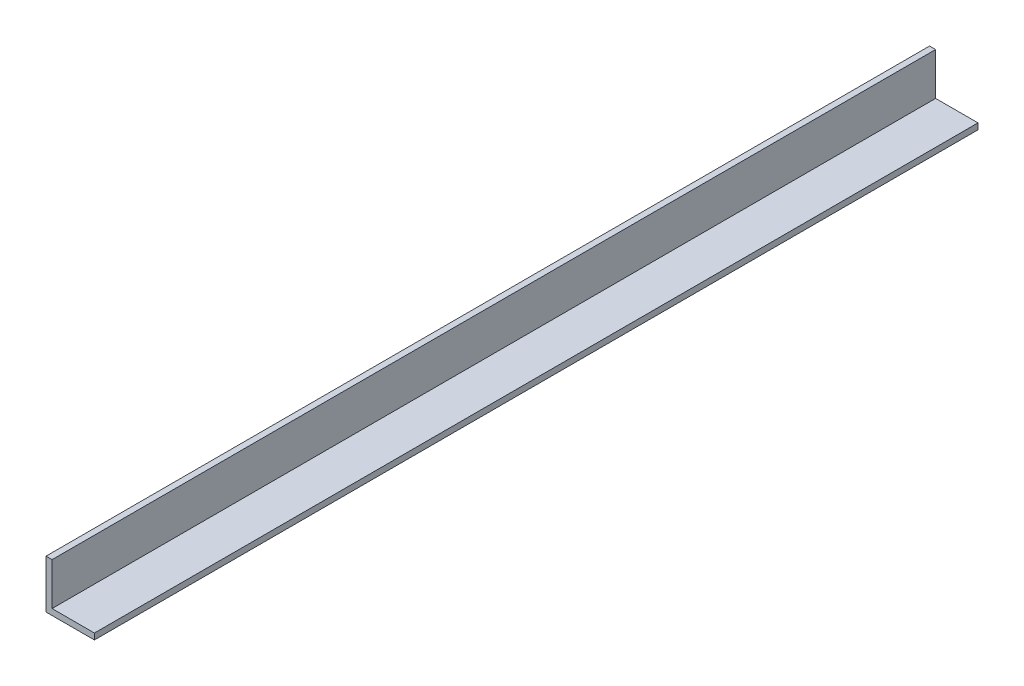
ISO-10303-21;
HEADER;
FILE_DESCRIPTION(('STEP AP214'),'2;1');
FILE_NAME('part.step','',(''),(''),'','','');
FILE_SCHEMA(('AUTOMOTIVE_DESIGN { 1 0 10303 214 1 1 1 1 }'));
ENDSEC;
DATA;
#1=APPLICATION_CONTEXT('core data for automotive mechanical design processes');
#2=APPLICATION_PROTOCOL_DEFINITION('international standard','automotive_design',2000,#1);
#3=PRODUCT_CONTEXT('',#1,'mechanical');
#4=PRODUCT('Part','Part','',(#3));
#5=PRODUCT_RELATED_PRODUCT_CATEGORY('part','',(#4));
#6=PRODUCT_DEFINITION_FORMATION('','',#4);
#7=PRODUCT_DEFINITION_CONTEXT('part definition',#1,'design');
#8=PRODUCT_DEFINITION('design','',#6,#7);
#9=PRODUCT_DEFINITION_SHAPE('','',#8);
#10=(LENGTH_UNIT() NAMED_UNIT(*) SI_UNIT(.MILLI.,.METRE.));
#11=(NAMED_UNIT(*) PLANE_ANGLE_UNIT() SI_UNIT($,.RADIAN.));
#12=(NAMED_UNIT(*) SI_UNIT($,.STERADIAN.) SOLID_ANGLE_UNIT());
#13=UNCERTAINTY_MEASURE_WITH_UNIT(LENGTH_MEASURE(1.E-05),#10,'distance_accuracy_value','');
#14=(GEOMETRIC_REPRESENTATION_CONTEXT(3) GLOBAL_UNCERTAINTY_ASSIGNED_CONTEXT((#13)) GLOBAL_UNIT_ASSIGNED_CONTEXT((#10,
#11,#12)) REPRESENTATION_CONTEXT('',''));
#15=CARTESIAN_POINT('',(0.,0.,0.));
#16=DIRECTION('',(0.,0.,1.));
#17=DIRECTION('',(1.,0.,0.));
#18=AXIS2_PLACEMENT_3D('',#15,#16,#17);
#19=CARTESIAN_POINT('',(50.8,6.34999999999991,927.1));
#20=DIRECTION('',(0.,-1.,0.));
#21=DIRECTION('',(0.,0.,-1.));
#22=AXIS2_PLACEMENT_3D('',#19,#20,#21);
#23=PLANE('',#22);
#24=DIRECTION('',(-1.,0.,0.));
#25=VECTOR('',#24,1.);
#26=CARTESIAN_POINT('',(50.8,6.34999999999991,0.));
#27=LINE('',#26,#25);
#28=CARTESIAN_POINT('',(50.8,6.34999999999991,0.));
#29=VERTEX_POINT('',#28);
#30=CARTESIAN_POINT('',(6.34999999999986,6.34999999999991,0.));
#31=VERTEX_POINT('',#30);
#32=EDGE_CURVE('E117',#29,#31,#27,.T.);
#33=ORIENTED_EDGE('',*,*,#32,.T.);
#34=DIRECTION('',(0.,0.,-1.));
#35=VECTOR('',#34,1.);
#36=CARTESIAN_POINT('',(6.34999999999986,6.34999999999991,927.1));
#37=LINE('',#36,#35);
#38=CARTESIAN_POINT('',(6.34999999999986,6.34999999999991,927.1));
#39=VERTEX_POINT('',#38);
#40=EDGE_CURVE('E11',#39,#31,#37,.T.);
#41=ORIENTED_EDGE('',*,*,#40,.F.);
#42=DIRECTION('',(-1.,0.,0.));
#43=VECTOR('',#42,1.);
#44=CARTESIAN_POINT('',(50.8,6.34999999999991,927.1));
#45=LINE('',#44,#43);
#46=CARTESIAN_POINT('',(50.8,6.34999999999991,927.1));
#47=VERTEX_POINT('',#46);
#48=EDGE_CURVE('E127',#47,#39,#45,.T.);
#49=ORIENTED_EDGE('',*,*,#48,.F.);
#50=DIRECTION('',(0.,0.,-1.));
#51=VECTOR('',#50,1.);
#52=CARTESIAN_POINT('',(50.8,6.34999999999991,927.1));
#53=LINE('',#52,#51);
#54=EDGE_CURVE('E113',#47,#29,#53,.T.);
#55=ORIENTED_EDGE('',*,*,#54,.T.);
#56=EDGE_LOOP('',(#33,#41,#49,#55));
#57=FACE_BOUND('',#56,.T.);
#58=ADVANCED_FACE('F33',(#57),#23,.F.);
#59=CARTESIAN_POINT('',(6.34999999999986,6.34999999999991,927.1));
#60=DIRECTION('',(-1.,0.,0.));
#61=DIRECTION('',(0.,0.,1.));
#62=AXIS2_PLACEMENT_3D('',#59,#60,#61);
#63=PLANE('',#62);
#64=DIRECTION('',(0.,1.,0.));
#65=VECTOR('',#64,1.);
#66=CARTESIAN_POINT('',(6.34999999999986,6.34999999999991,0.));
#67=LINE('',#66,#65);
#68=CARTESIAN_POINT('',(6.34999999999986,50.8,0.));
#69=VERTEX_POINT('',#68);
#70=EDGE_CURVE('E120',#31,#69,#67,.T.);
#71=ORIENTED_EDGE('',*,*,#70,.T.);
#72=DIRECTION('',(0.,0.,-1.));
#73=VECTOR('',#72,1.);
#74=CARTESIAN_POINT('',(6.34999999999986,50.8,927.1));
#75=LINE('',#74,#73);
#76=CARTESIAN_POINT('',(6.34999999999986,50.8,927.1));
#77=VERTEX_POINT('',#76);
#78=EDGE_CURVE('E41',#77,#69,#75,.T.);
#79=ORIENTED_EDGE('',*,*,#78,.F.);
#80=DIRECTION('',(0.,1.,0.));
#81=VECTOR('',#80,1.);
#82=CARTESIAN_POINT('',(6.34999999999986,6.34999999999991,927.1));
#83=LINE('',#82,#81);
#84=EDGE_CURVE('E86',#39,#77,#83,.T.);
#85=ORIENTED_EDGE('',*,*,#84,.F.);
#86=ORIENTED_EDGE('',*,*,#40,.T.);
#87=EDGE_LOOP('',(#71,#79,#85,#86));
#88=FACE_BOUND('',#87,.T.);
#89=ADVANCED_FACE('F151',(#88),#63,.F.);
#90=CARTESIAN_POINT('',(6.34999999999986,50.8,927.1));
#91=DIRECTION('',(0.,-1.,0.));
#92=DIRECTION('',(0.,0.,-1.));
#93=AXIS2_PLACEMENT_3D('',#90,#91,#92);
#94=PLANE('',#93);
#95=DIRECTION('',(-1.,0.,0.));
#96=VECTOR('',#95,1.);
#97=CARTESIAN_POINT('',(6.34999999999986,50.8,0.));
#98=LINE('',#97,#96);
#99=CARTESIAN_POINT('',(-2.22044604925031E-13,50.8,0.));
#100=VERTEX_POINT('',#99);
#101=EDGE_CURVE('E122',#69,#100,#98,.T.);
#102=ORIENTED_EDGE('',*,*,#101,.T.);
#103=DIRECTION('',(0.,0.,-1.));
#104=VECTOR('',#103,1.);
#105=CARTESIAN_POINT('',(-2.22044604925031E-13,50.8,927.1));
#106=LINE('',#105,#104);
#107=CARTESIAN_POINT('',(-2.22044604925031E-13,50.8,927.1));
#108=VERTEX_POINT('',#107);
#109=EDGE_CURVE('E108',#108,#100,#106,.T.);
#110=ORIENTED_EDGE('',*,*,#109,.F.);
#111=DIRECTION('',(-1.,0.,0.));
#112=VECTOR('',#111,1.);
#113=CARTESIAN_POINT('',(6.34999999999986,50.8,927.1));
#114=LINE('',#113,#112);
#115=EDGE_CURVE('E99',#77,#108,#114,.T.);
#116=ORIENTED_EDGE('',*,*,#115,.F.);
#117=ORIENTED_EDGE('',*,*,#78,.T.);
#118=EDGE_LOOP('',(#102,#110,#116,#117));
#119=FACE_BOUND('',#118,.T.);
#120=ADVANCED_FACE('F133',(#119),#94,.F.);
#121=CARTESIAN_POINT('',(0.,0.,927.1));
#122=DIRECTION('',(1.,0.,0.));
#123=DIRECTION('',(0.,1.,0.));
#124=AXIS2_PLACEMENT_3D('',#121,#122,#123);
#125=PLANE('',#124);
#126=DIRECTION('',(0.,-1.,0.));
#127=VECTOR('',#126,1.);
#128=CARTESIAN_POINT('',(0.,0.,0.));
#129=LINE('',#128,#127);
#130=CARTESIAN_POINT('',(0.,0.,0.));
#131=VERTEX_POINT('',#130);
#132=EDGE_CURVE('E107',#100,#131,#129,.T.);
#133=ORIENTED_EDGE('',*,*,#132,.T.);
#134=DIRECTION('',(0.,0.,-1.));
#135=VECTOR('',#134,1.);
#136=CARTESIAN_POINT('',(0.,0.,927.1));
#137=LINE('',#136,#135);
#138=CARTESIAN_POINT('',(0.,0.,927.1));
#139=VERTEX_POINT('',#138);
#140=EDGE_CURVE('E104',#139,#131,#137,.T.);
#141=ORIENTED_EDGE('',*,*,#140,.F.);
#142=DIRECTION('',(0.,-1.,0.));
#143=VECTOR('',#142,1.);
#144=CARTESIAN_POINT('',(0.,0.,927.1));
#145=LINE('',#144,#143);
#146=EDGE_CURVE('E93',#108,#139,#145,.T.);
#147=ORIENTED_EDGE('',*,*,#146,.F.);
#148=ORIENTED_EDGE('',*,*,#109,.T.);
#149=EDGE_LOOP('',(#133,#141,#147,#148));
#150=FACE_BOUND('',#149,.T.);
#151=ADVANCED_FACE('F105',(#150),#125,.F.);
#152=CARTESIAN_POINT('',(0.,0.,927.1));
#153=DIRECTION('',(0.,1.,0.));
#154=DIRECTION('',(-1.,0.,0.));
#155=AXIS2_PLACEMENT_3D('',#152,#153,#154);
#156=PLANE('',#155);
#157=DIRECTION('',(1.,0.,0.));
#158=VECTOR('',#157,1.);
#159=CARTESIAN_POINT('',(0.,0.,0.));
#160=LINE('',#159,#158);
#161=CARTESIAN_POINT('',(50.8,0.,0.));
#162=VERTEX_POINT('',#161);
#163=EDGE_CURVE('E72',#131,#162,#160,.T.);
#164=ORIENTED_EDGE('',*,*,#163,.T.);
#165=DIRECTION('',(0.,0.,-1.));
#166=VECTOR('',#165,1.);
#167=CARTESIAN_POINT('',(50.8,0.,927.1));
#168=LINE('',#167,#166);
#169=CARTESIAN_POINT('',(50.8,0.,927.1));
#170=VERTEX_POINT('',#169);
#171=EDGE_CURVE('E109',#170,#162,#168,.T.);
#172=ORIENTED_EDGE('',*,*,#171,.F.);
#173=DIRECTION('',(1.,0.,0.));
#174=VECTOR('',#173,1.);
#175=CARTESIAN_POINT('',(0.,0.,927.1));
#176=LINE('',#175,#174);
#177=EDGE_CURVE('E97',#139,#170,#176,.T.);
#178=ORIENTED_EDGE('',*,*,#177,.F.);
#179=ORIENTED_EDGE('',*,*,#140,.T.);
#180=EDGE_LOOP('',(#164,#172,#178,#179));
#181=FACE_BOUND('',#180,.T.);
#182=ADVANCED_FACE('F111',(#181),#156,.F.);
#183=CARTESIAN_POINT('',(50.8,0.,927.1));
#184=DIRECTION('',(-1.,0.,0.));
#185=DIRECTION('',(0.,0.,1.));
#186=AXIS2_PLACEMENT_3D('',#183,#184,#185);
#187=PLANE('',#186);
#188=DIRECTION('',(0.,1.,0.));
#189=VECTOR('',#188,1.);
#190=CARTESIAN_POINT('',(50.8,0.,0.));
#191=LINE('',#190,#189);
#192=EDGE_CURVE('E78',#162,#29,#191,.T.);
#193=ORIENTED_EDGE('',*,*,#192,.T.);
#194=ORIENTED_EDGE('',*,*,#54,.F.);
#195=DIRECTION('',(0.,1.,0.));
#196=VECTOR('',#195,1.);
#197=CARTESIAN_POINT('',(50.8,0.,927.1));
#198=LINE('',#197,#196);
#199=EDGE_CURVE('E49',#170,#47,#198,.T.);
#200=ORIENTED_EDGE('',*,*,#199,.F.);
#201=ORIENTED_EDGE('',*,*,#171,.T.);
#202=EDGE_LOOP('',(#193,#194,#200,#201));
#203=FACE_BOUND('',#202,.T.);
#204=ADVANCED_FACE('F140',(#203),#187,.F.);
#205=CARTESIAN_POINT('',(0.,0.,927.1));
#206=DIRECTION('',(0.,0.,-1.));
#207=DIRECTION('',(-1.,0.,0.));
#208=AXIS2_PLACEMENT_3D('',#205,#206,#207);
#209=PLANE('',#208);
#210=ORIENTED_EDGE('',*,*,#48,.T.);
#211=ORIENTED_EDGE('',*,*,#84,.T.);
#212=ORIENTED_EDGE('',*,*,#115,.T.);
#213=ORIENTED_EDGE('',*,*,#146,.T.);
#214=ORIENTED_EDGE('',*,*,#177,.T.);
#215=ORIENTED_EDGE('',*,*,#199,.T.);
#216=EDGE_LOOP('',(#210,#211,#212,#213,#214,#215));
#217=FACE_BOUND('',#216,.T.);
#218=ADVANCED_FACE('F95',(#217),#209,.F.);
#219=CARTESIAN_POINT('',(0.,0.,0.));
#220=DIRECTION('',(0.,0.,-1.));
#221=DIRECTION('',(-1.,0.,0.));
#222=AXIS2_PLACEMENT_3D('',#219,#220,#221);
#223=PLANE('',#222);
#224=ORIENTED_EDGE('',*,*,#32,.F.);
#225=ORIENTED_EDGE('',*,*,#192,.F.);
#226=ORIENTED_EDGE('',*,*,#163,.F.);
#227=ORIENTED_EDGE('',*,*,#132,.F.);
#228=ORIENTED_EDGE('',*,*,#101,.F.);
#229=ORIENTED_EDGE('',*,*,#70,.F.);
#230=EDGE_LOOP('',(#224,#225,#226,#227,#228,#229));
#231=FACE_BOUND('',#230,.T.);
#232=ADVANCED_FACE('F136',(#231),#223,.T.);
#233=CLOSED_SHELL('',(#58,#89,#120,#151,#182,#204,#218,#232));
#234=MANIFOLD_SOLID_BREP('B2',#233);
#235=ADVANCED_BREP_SHAPE_REPRESENTATION('',(#18,#234),#14);
#236=SHAPE_DEFINITION_REPRESENTATION(#9,#235);
ENDSEC;
END-ISO-10303-21;
